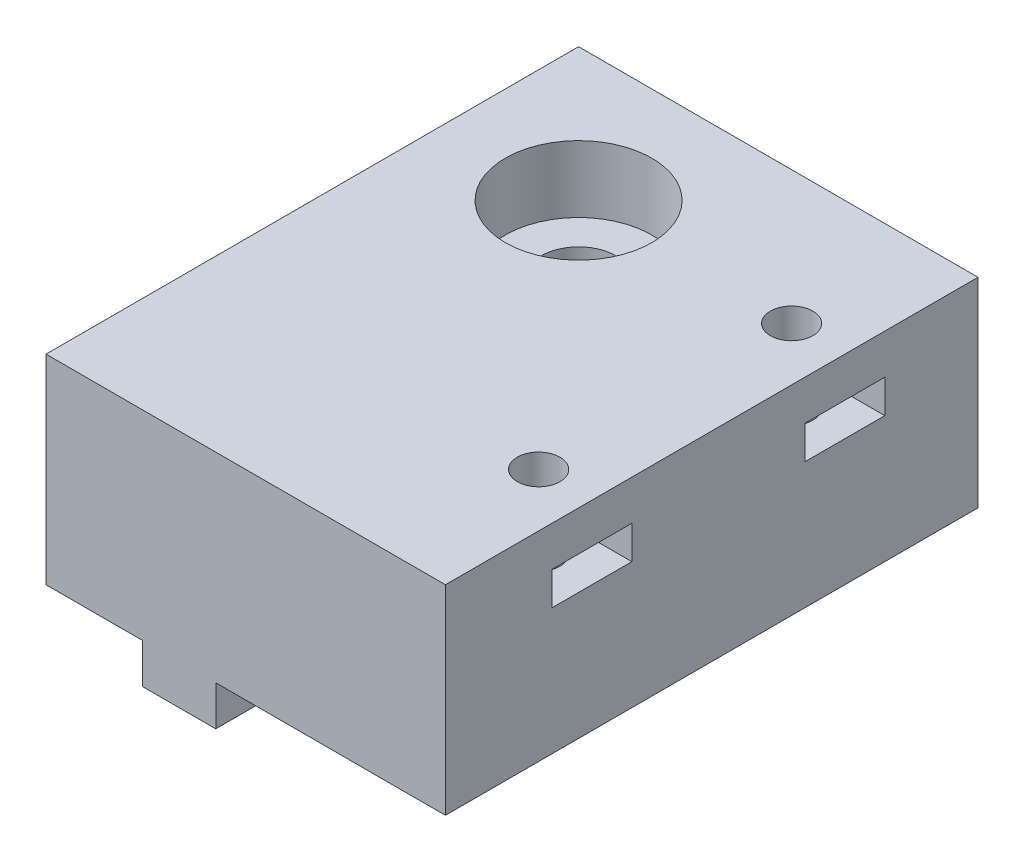
ISO-10303-21;
HEADER;
FILE_DESCRIPTION(('STEP AP214'),'2;1');
FILE_NAME('part.step','',(''),(''),'','','');
FILE_SCHEMA(('AUTOMOTIVE_DESIGN { 1 0 10303 214 1 1 1 1 }'));
ENDSEC;
DATA;
#1=APPLICATION_CONTEXT('core data for automotive mechanical design processes');
#2=APPLICATION_PROTOCOL_DEFINITION('international standard','automotive_design',2000,#1);
#3=PRODUCT_CONTEXT('',#1,'mechanical');
#4=PRODUCT('Part','Part','',(#3));
#5=PRODUCT_RELATED_PRODUCT_CATEGORY('part','',(#4));
#6=PRODUCT_DEFINITION_FORMATION('','',#4);
#7=PRODUCT_DEFINITION_CONTEXT('part definition',#1,'design');
#8=PRODUCT_DEFINITION('design','',#6,#7);
#9=PRODUCT_DEFINITION_SHAPE('','',#8);
#10=(LENGTH_UNIT() NAMED_UNIT(*) SI_UNIT(.MILLI.,.METRE.));
#11=(NAMED_UNIT(*) PLANE_ANGLE_UNIT() SI_UNIT($,.RADIAN.));
#12=(NAMED_UNIT(*) SI_UNIT($,.STERADIAN.) SOLID_ANGLE_UNIT());
#13=UNCERTAINTY_MEASURE_WITH_UNIT(LENGTH_MEASURE(1.E-05),#10,'distance_accuracy_value','');
#14=(GEOMETRIC_REPRESENTATION_CONTEXT(3) GLOBAL_UNCERTAINTY_ASSIGNED_CONTEXT((#13)) GLOBAL_UNIT_ASSIGNED_CONTEXT((#10,
#11,#12)) REPRESENTATION_CONTEXT('',''));
#15=CARTESIAN_POINT('',(0.,0.,0.));
#16=DIRECTION('',(0.,0.,1.));
#17=DIRECTION('',(1.,0.,0.));
#18=AXIS2_PLACEMENT_3D('',#15,#16,#17);
#19=CARTESIAN_POINT('',(0.,0.,0.));
#20=DIRECTION('',(0.,-1.,0.));
#21=DIRECTION('',(0.,0.,-1.));
#22=AXIS2_PLACEMENT_3D('',#19,#20,#21);
#23=PLANE('',#22);
#24=CARTESIAN_POINT('',(9.30324177956045,0.,-30.));
#25=DIRECTION('',(0.,1.,0.));
#26=DIRECTION('',(0.,0.,1.));
#27=AXIS2_PLACEMENT_3D('',#24,#25,#26);
#28=CIRCLE('',#27,2.8);
#29=CARTESIAN_POINT('',(9.30324177956045,0.,-27.2));
#30=VERTEX_POINT('',#29);
#31=EDGE_CURVE('E235',#30,#30,#28,.T.);
#32=ORIENTED_EDGE('',*,*,#31,.T.);
#33=EDGE_LOOP('',(#32));
#34=FACE_BOUND('',#33,.T.);
#35=CARTESIAN_POINT('',(25.3032417795605,0.,-30.));
#36=DIRECTION('',(0.,1.,0.));
#37=DIRECTION('',(0.,0.,1.));
#38=AXIS2_PLACEMENT_3D('',#35,#36,#37);
#39=CIRCLE('',#38,1.60000000000001);
#40=CARTESIAN_POINT('',(25.3032417795605,0.,-28.4));
#41=VERTEX_POINT('',#40);
#42=EDGE_CURVE('E305',#41,#41,#39,.T.);
#43=ORIENTED_EDGE('',*,*,#42,.T.);
#44=EDGE_LOOP('',(#43));
#45=FACE_BOUND('',#44,.T.);
#46=CARTESIAN_POINT('',(25.3032417795605,0.,-11.));
#47=DIRECTION('',(0.,1.,0.));
#48=DIRECTION('',(0.,0.,1.));
#49=AXIS2_PLACEMENT_3D('',#46,#47,#48);
#50=CIRCLE('',#49,1.6);
#51=CARTESIAN_POINT('',(25.3032417795605,0.,-9.4));
#52=VERTEX_POINT('',#51);
#53=EDGE_CURVE('E313',#52,#52,#50,.T.);
#54=ORIENTED_EDGE('',*,*,#53,.T.);
#55=EDGE_LOOP('',(#54));
#56=FACE_BOUND('',#55,.T.);
#57=DIRECTION('',(-1.,0.,0.));
#58=VECTOR('',#57,1.);
#59=CARTESIAN_POINT('',(6.55324177956045,0.,-37.5));
#60=LINE('',#59,#58);
#61=CARTESIAN_POINT('',(12.0532417795605,0.,-37.5));
#62=VERTEX_POINT('',#61);
#63=CARTESIAN_POINT('',(6.55324177956045,0.,-37.5));
#64=VERTEX_POINT('',#63);
#65=EDGE_CURVE('E470',#62,#64,#60,.T.);
#66=ORIENTED_EDGE('',*,*,#65,.F.);
#67=DIRECTION('',(0.,0.,1.));
#68=VECTOR('',#67,1.);
#69=CARTESIAN_POINT('',(12.0532417795605,0.,-37.5));
#70=LINE('',#69,#68);
#71=CARTESIAN_POINT('',(12.0532417795605,0.,-40.));
#72=VERTEX_POINT('',#71);
#73=EDGE_CURVE('E196',#72,#62,#70,.T.);
#74=ORIENTED_EDGE('',*,*,#73,.F.);
#75=DIRECTION('',(-1.,0.,0.));
#76=VECTOR('',#75,1.);
#77=CARTESIAN_POINT('',(-0.696758220439547,0.,-40.));
#78=LINE('',#77,#76);
#79=CARTESIAN_POINT('',(29.3032417795605,0.,-40.));
#80=VERTEX_POINT('',#79);
#81=EDGE_CURVE('E323',#80,#72,#78,.T.);
#82=ORIENTED_EDGE('',*,*,#81,.F.);
#83=DIRECTION('',(0.,0.,-1.));
#84=VECTOR('',#83,1.);
#85=CARTESIAN_POINT('',(29.3032417795605,0.,0.));
#86=LINE('',#85,#84);
#87=CARTESIAN_POINT('',(29.3032417795605,0.,0.));
#88=VERTEX_POINT('',#87);
#89=EDGE_CURVE('E336',#88,#80,#86,.T.);
#90=ORIENTED_EDGE('',*,*,#89,.F.);
#91=DIRECTION('',(1.,0.,0.));
#92=VECTOR('',#91,1.);
#93=CARTESIAN_POINT('',(-0.696758220439547,0.,0.));
#94=LINE('',#93,#92);
#95=CARTESIAN_POINT('',(12.0532417795604,0.,0.));
#96=VERTEX_POINT('',#95);
#97=EDGE_CURVE('E332',#96,#88,#94,.T.);
#98=ORIENTED_EDGE('',*,*,#97,.F.);
#99=DIRECTION('',(0.,0.,1.));
#100=VECTOR('',#99,1.);
#101=CARTESIAN_POINT('',(12.0532417795604,0.,0.));
#102=LINE('',#101,#100);
#103=CARTESIAN_POINT('',(12.0532417795605,0.,-22.5));
#104=VERTEX_POINT('',#103);
#105=EDGE_CURVE('E209',#104,#96,#102,.T.);
#106=ORIENTED_EDGE('',*,*,#105,.F.);
#107=DIRECTION('',(1.,0.,0.));
#108=VECTOR('',#107,1.);
#109=CARTESIAN_POINT('',(6.55324177956045,0.,-22.5));
#110=LINE('',#109,#108);
#111=CARTESIAN_POINT('',(6.55324177956045,0.,-22.5));
#112=VERTEX_POINT('',#111);
#113=EDGE_CURVE('E60',#112,#104,#110,.T.);
#114=ORIENTED_EDGE('',*,*,#113,.F.);
#115=DIRECTION('',(0.,0.,-1.));
#116=VECTOR('',#115,1.);
#117=CARTESIAN_POINT('',(6.55324177956045,0.,0.));
#118=LINE('',#117,#116);
#119=CARTESIAN_POINT('',(6.55324177956045,0.,0.));
#120=VERTEX_POINT('',#119);
#121=EDGE_CURVE('E198',#120,#112,#118,.T.);
#122=ORIENTED_EDGE('',*,*,#121,.F.);
#123=CARTESIAN_POINT('',(-0.696758220439547,0.,0.));
#124=VERTEX_POINT('',#123);
#125=EDGE_CURVE('E333',#124,#120,#94,.T.);
#126=ORIENTED_EDGE('',*,*,#125,.F.);
#127=DIRECTION('',(0.,0.,1.));
#128=VECTOR('',#127,1.);
#129=CARTESIAN_POINT('',(-0.696758220439547,0.,0.));
#130=LINE('',#129,#128);
#131=CARTESIAN_POINT('',(-0.696758220439547,0.,-40.));
#132=VERTEX_POINT('',#131);
#133=EDGE_CURVE('E316',#132,#124,#130,.T.);
#134=ORIENTED_EDGE('',*,*,#133,.F.);
#135=CARTESIAN_POINT('',(6.55324177956046,0.,-40.));
#136=VERTEX_POINT('',#135);
#137=EDGE_CURVE('E338',#136,#132,#78,.T.);
#138=ORIENTED_EDGE('',*,*,#137,.F.);
#139=DIRECTION('',(0.,0.,-1.));
#140=VECTOR('',#139,1.);
#141=CARTESIAN_POINT('',(6.55324177956045,0.,-37.5));
#142=LINE('',#141,#140);
#143=EDGE_CURVE('E192',#64,#136,#142,.T.);
#144=ORIENTED_EDGE('',*,*,#143,.F.);
#145=EDGE_LOOP('',(#66,#74,#82,#90,#98,#106,#114,#122,#126,#134,#138,#144));
#146=FACE_BOUND('',#145,.T.);
#147=ADVANCED_FACE('F35',(#34,#45,#56,#146),#23,.T.);
#148=CARTESIAN_POINT('',(9.30324177956045,0.,-30.));
#149=DIRECTION('',(0.,1.,0.));
#150=DIRECTION('',(0.,0.,1.));
#151=AXIS2_PLACEMENT_3D('',#148,#149,#150);
#152=CYLINDRICAL_SURFACE('',#151,2.8);
#153=ORIENTED_EDGE('',*,*,#31,.F.);
#154=EDGE_LOOP('',(#153));
#155=FACE_BOUND('',#154,.T.);
#156=CARTESIAN_POINT('',(9.30324177956045,10.,-30.));
#157=DIRECTION('',(0.,1.,0.));
#158=DIRECTION('',(0.,0.,1.));
#159=AXIS2_PLACEMENT_3D('',#156,#157,#158);
#160=CIRCLE('',#159,2.8);
#161=CARTESIAN_POINT('',(9.30324177956045,10.,-27.2));
#162=VERTEX_POINT('',#161);
#163=EDGE_CURVE('E39',#162,#162,#160,.F.);
#164=ORIENTED_EDGE('',*,*,#163,.F.);
#165=EDGE_LOOP('',(#164));
#166=FACE_BOUND('',#165,.T.);
#167=ADVANCED_FACE('F378',(#155,#166),#152,.F.);
#168=CARTESIAN_POINT('',(25.3032417795605,0.,-30.));
#169=DIRECTION('',(0.,1.,0.));
#170=DIRECTION('',(0.,0.,1.));
#171=AXIS2_PLACEMENT_3D('',#168,#169,#170);
#172=CYLINDRICAL_SURFACE('',#171,1.60000000000001);
#173=CARTESIAN_POINT('',(25.3032417795605,12.,-30.));
#174=DIRECTION('',(0.,1.,0.));
#175=DIRECTION('',(0.,0.,1.));
#176=AXIS2_PLACEMENT_3D('',#173,#174,#175);
#177=CIRCLE('',#176,1.60000000000001);
#178=CARTESIAN_POINT('',(25.3032417795605,12.,-28.4));
#179=VERTEX_POINT('',#178);
#180=EDGE_CURVE('E288',#179,#179,#177,.F.);
#181=ORIENTED_EDGE('',*,*,#180,.T.);
#182=EDGE_LOOP('',(#181));
#183=FACE_BOUND('',#182,.T.);
#184=CARTESIAN_POINT('',(25.3032417795605,15.,-30.));
#185=DIRECTION('',(0.,1.,0.));
#186=DIRECTION('',(0.,0.,1.));
#187=AXIS2_PLACEMENT_3D('',#184,#185,#186);
#188=CIRCLE('',#187,1.60000000000001);
#189=CARTESIAN_POINT('',(25.3032417795605,15.,-28.4));
#190=VERTEX_POINT('',#189);
#191=EDGE_CURVE('E309',#190,#190,#188,.T.);
#192=ORIENTED_EDGE('',*,*,#191,.T.);
#193=EDGE_LOOP('',(#192));
#194=FACE_BOUND('',#193,.T.);
#195=ADVANCED_FACE('F356',(#183,#194),#172,.F.);
#196=CARTESIAN_POINT('',(25.3032417795605,0.,-11.));
#197=DIRECTION('',(0.,1.,0.));
#198=DIRECTION('',(0.,0.,1.));
#199=AXIS2_PLACEMENT_3D('',#196,#197,#198);
#200=CYLINDRICAL_SURFACE('',#199,1.6);
#201=CARTESIAN_POINT('',(25.3032417795605,12.,-11.));
#202=DIRECTION('',(0.,1.,0.));
#203=DIRECTION('',(0.,0.,1.));
#204=AXIS2_PLACEMENT_3D('',#201,#202,#203);
#205=CIRCLE('',#204,1.6);
#206=CARTESIAN_POINT('',(25.3032417795605,12.,-9.4));
#207=VERTEX_POINT('',#206);
#208=EDGE_CURVE('E312',#207,#207,#205,.F.);
#209=ORIENTED_EDGE('',*,*,#208,.T.);
#210=EDGE_LOOP('',(#209));
#211=FACE_BOUND('',#210,.T.);
#212=CARTESIAN_POINT('',(25.3032417795605,15.,-11.));
#213=DIRECTION('',(0.,1.,0.));
#214=DIRECTION('',(0.,0.,1.));
#215=AXIS2_PLACEMENT_3D('',#212,#213,#214);
#216=CIRCLE('',#215,1.6);
#217=CARTESIAN_POINT('',(25.3032417795605,15.,-9.4));
#218=VERTEX_POINT('',#217);
#219=EDGE_CURVE('E308',#218,#218,#216,.T.);
#220=ORIENTED_EDGE('',*,*,#219,.T.);
#221=EDGE_LOOP('',(#220));
#222=FACE_BOUND('',#221,.T.);
#223=ADVANCED_FACE('F403',(#211,#222),#200,.F.);
#224=CARTESIAN_POINT('',(-0.696758220439547,15.,0.));
#225=DIRECTION('',(1.,0.,0.));
#226=DIRECTION('',(0.,0.,-1.));
#227=AXIS2_PLACEMENT_3D('',#224,#225,#226);
#228=PLANE('',#227);
#229=ORIENTED_EDGE('',*,*,#133,.T.);
#230=DIRECTION('',(0.,-1.,0.));
#231=VECTOR('',#230,1.);
#232=CARTESIAN_POINT('',(-0.696758220439547,15.,0.));
#233=LINE('',#232,#231);
#234=CARTESIAN_POINT('',(-0.696758220439547,15.,0.));
#235=VERTEX_POINT('',#234);
#236=EDGE_CURVE('E11',#235,#124,#233,.T.);
#237=ORIENTED_EDGE('',*,*,#236,.F.);
#238=DIRECTION('',(0.,0.,1.));
#239=VECTOR('',#238,1.);
#240=CARTESIAN_POINT('',(-0.696758220439547,15.,0.));
#241=LINE('',#240,#239);
#242=CARTESIAN_POINT('',(-0.696758220439547,15.,-40.));
#243=VERTEX_POINT('',#242);
#244=EDGE_CURVE('E319',#243,#235,#241,.T.);
#245=ORIENTED_EDGE('',*,*,#244,.F.);
#246=DIRECTION('',(0.,-1.,0.));
#247=VECTOR('',#246,1.);
#248=CARTESIAN_POINT('',(-0.696758220439547,15.,-40.));
#249=LINE('',#248,#247);
#250=EDGE_CURVE('E329',#243,#132,#249,.T.);
#251=ORIENTED_EDGE('',*,*,#250,.T.);
#252=EDGE_LOOP('',(#229,#237,#245,#251));
#253=FACE_BOUND('',#252,.T.);
#254=ADVANCED_FACE('F37',(#253),#228,.F.);
#255=CARTESIAN_POINT('',(-0.696758220439547,15.,0.));
#256=DIRECTION('',(0.,0.,-1.));
#257=DIRECTION('',(-1.,0.,0.));
#258=AXIS2_PLACEMENT_3D('',#255,#256,#257);
#259=PLANE('',#258);
#260=ORIENTED_EDGE('',*,*,#125,.T.);
#261=DIRECTION('',(0.,1.,0.));
#262=VECTOR('',#261,1.);
#263=CARTESIAN_POINT('',(6.55324177956045,-3.,0.));
#264=LINE('',#263,#262);
#265=CARTESIAN_POINT('',(6.55324177956045,-3.,0.));
#266=VERTEX_POINT('',#265);
#267=EDGE_CURVE('E214',#266,#120,#264,.T.);
#268=ORIENTED_EDGE('',*,*,#267,.F.);
#269=DIRECTION('',(-1.,0.,0.));
#270=VECTOR('',#269,1.);
#271=CARTESIAN_POINT('',(6.55324177956045,-3.,0.));
#272=LINE('',#271,#270);
#273=CARTESIAN_POINT('',(12.0532417795604,-3.,0.));
#274=VERTEX_POINT('',#273);
#275=EDGE_CURVE('E213',#274,#266,#272,.T.);
#276=ORIENTED_EDGE('',*,*,#275,.F.);
#277=DIRECTION('',(0.,1.,0.));
#278=VECTOR('',#277,1.);
#279=CARTESIAN_POINT('',(12.0532417795604,-3.,0.));
#280=LINE('',#279,#278);
#281=EDGE_CURVE('E221',#274,#96,#280,.T.);
#282=ORIENTED_EDGE('',*,*,#281,.T.);
#283=ORIENTED_EDGE('',*,*,#97,.T.);
#284=DIRECTION('',(0.,-1.,0.));
#285=VECTOR('',#284,1.);
#286=CARTESIAN_POINT('',(29.3032417795605,15.,0.));
#287=LINE('',#286,#285);
#288=CARTESIAN_POINT('',(29.3032417795605,15.,0.));
#289=VERTEX_POINT('',#288);
#290=EDGE_CURVE('E44',#289,#88,#287,.T.);
#291=ORIENTED_EDGE('',*,*,#290,.F.);
#292=DIRECTION('',(1.,0.,0.));
#293=VECTOR('',#292,1.);
#294=CARTESIAN_POINT('',(-0.696758220439547,15.,0.));
#295=LINE('',#294,#293);
#296=EDGE_CURVE('E322',#235,#289,#295,.T.);
#297=ORIENTED_EDGE('',*,*,#296,.F.);
#298=ORIENTED_EDGE('',*,*,#236,.T.);
#299=EDGE_LOOP('',(#260,#268,#276,#282,#283,#291,#297,#298));
#300=FACE_BOUND('',#299,.T.);
#301=ADVANCED_FACE('F396',(#300),#259,.F.);
#302=CARTESIAN_POINT('',(29.3032417795605,15.,0.));
#303=DIRECTION('',(-1.,0.,0.));
#304=DIRECTION('',(0.,0.,1.));
#305=AXIS2_PLACEMENT_3D('',#302,#303,#304);
#306=PLANE('',#305);
#307=DIRECTION('',(0.,0.,-1.));
#308=VECTOR('',#307,1.);
#309=CARTESIAN_POINT('',(29.3032417795605,9.5,-27.));
#310=LINE('',#309,#308);
#311=CARTESIAN_POINT('',(29.3032417795605,9.5,-27.));
#312=VERTEX_POINT('',#311);
#313=CARTESIAN_POINT('',(29.3032417795605,9.5,-33.));
#314=VERTEX_POINT('',#313);
#315=EDGE_CURVE('E254',#312,#314,#310,.T.);
#316=ORIENTED_EDGE('',*,*,#315,.F.);
#317=DIRECTION('',(0.,-1.,0.));
#318=VECTOR('',#317,1.);
#319=CARTESIAN_POINT('',(29.3032417795605,12.,-27.));
#320=LINE('',#319,#318);
#321=CARTESIAN_POINT('',(29.3032417795605,12.,-27.));
#322=VERTEX_POINT('',#321);
#323=EDGE_CURVE('E238',#322,#312,#320,.T.);
#324=ORIENTED_EDGE('',*,*,#323,.F.);
#325=DIRECTION('',(0.,0.,1.));
#326=VECTOR('',#325,1.);
#327=CARTESIAN_POINT('',(29.3032417795605,12.,-27.));
#328=LINE('',#327,#326);
#329=CARTESIAN_POINT('',(29.3032417795605,12.,-33.));
#330=VERTEX_POINT('',#329);
#331=EDGE_CURVE('E243',#330,#322,#328,.T.);
#332=ORIENTED_EDGE('',*,*,#331,.F.);
#333=DIRECTION('',(0.,1.,0.));
#334=VECTOR('',#333,1.);
#335=CARTESIAN_POINT('',(29.3032417795605,12.,-33.));
#336=LINE('',#335,#334);
#337=EDGE_CURVE('E257',#314,#330,#336,.T.);
#338=ORIENTED_EDGE('',*,*,#337,.F.);
#339=EDGE_LOOP('',(#316,#324,#332,#338));
#340=FACE_BOUND('',#339,.T.);
#341=DIRECTION('',(0.,0.,-1.));
#342=VECTOR('',#341,1.);
#343=CARTESIAN_POINT('',(29.3032417795605,9.5,-8.));
#344=LINE('',#343,#342);
#345=CARTESIAN_POINT('',(29.3032417795605,9.5,-8.));
#346=VERTEX_POINT('',#345);
#347=CARTESIAN_POINT('',(29.3032417795605,9.5,-14.));
#348=VERTEX_POINT('',#347);
#349=EDGE_CURVE('E287',#346,#348,#344,.T.);
#350=ORIENTED_EDGE('',*,*,#349,.F.);
#351=DIRECTION('',(0.,-1.,0.));
#352=VECTOR('',#351,1.);
#353=CARTESIAN_POINT('',(29.3032417795605,12.,-8.));
#354=LINE('',#353,#352);
#355=CARTESIAN_POINT('',(29.3032417795605,12.,-8.));
#356=VERTEX_POINT('',#355);
#357=EDGE_CURVE('E285',#356,#346,#354,.T.);
#358=ORIENTED_EDGE('',*,*,#357,.F.);
#359=DIRECTION('',(0.,0.,1.));
#360=VECTOR('',#359,1.);
#361=CARTESIAN_POINT('',(29.3032417795605,12.,-8.));
#362=LINE('',#361,#360);
#363=CARTESIAN_POINT('',(29.3032417795605,12.,-14.));
#364=VERTEX_POINT('',#363);
#365=EDGE_CURVE('E275',#364,#356,#362,.T.);
#366=ORIENTED_EDGE('',*,*,#365,.F.);
#367=DIRECTION('',(0.,1.,0.));
#368=VECTOR('',#367,1.);
#369=CARTESIAN_POINT('',(29.3032417795605,12.,-14.));
#370=LINE('',#369,#368);
#371=EDGE_CURVE('E291',#348,#364,#370,.T.);
#372=ORIENTED_EDGE('',*,*,#371,.F.);
#373=EDGE_LOOP('',(#350,#358,#366,#372));
#374=FACE_BOUND('',#373,.T.);
#375=ORIENTED_EDGE('',*,*,#89,.T.);
#376=DIRECTION('',(0.,-1.,0.));
#377=VECTOR('',#376,1.);
#378=CARTESIAN_POINT('',(29.3032417795605,15.,-40.));
#379=LINE('',#378,#377);
#380=CARTESIAN_POINT('',(29.3032417795605,15.,-40.));
#381=VERTEX_POINT('',#380);
#382=EDGE_CURVE('E343',#381,#80,#379,.T.);
#383=ORIENTED_EDGE('',*,*,#382,.F.);
#384=DIRECTION('',(0.,0.,-1.));
#385=VECTOR('',#384,1.);
#386=CARTESIAN_POINT('',(29.3032417795605,15.,0.));
#387=LINE('',#386,#385);
#388=EDGE_CURVE('E325',#289,#381,#387,.T.);
#389=ORIENTED_EDGE('',*,*,#388,.F.);
#390=ORIENTED_EDGE('',*,*,#290,.T.);
#391=EDGE_LOOP('',(#375,#383,#389,#390));
#392=FACE_BOUND('',#391,.T.);
#393=ADVANCED_FACE('F394',(#340,#374,#392),#306,.F.);
#394=CARTESIAN_POINT('',(-0.696758220439547,15.,-40.));
#395=DIRECTION('',(0.,0.,1.));
#396=DIRECTION('',(1.,0.,0.));
#397=AXIS2_PLACEMENT_3D('',#394,#395,#396);
#398=PLANE('',#397);
#399=ORIENTED_EDGE('',*,*,#81,.T.);
#400=DIRECTION('',(0.,1.,0.));
#401=VECTOR('',#400,1.);
#402=CARTESIAN_POINT('',(12.0532417795605,-3.,-40.));
#403=LINE('',#402,#401);
#404=CARTESIAN_POINT('',(12.0532417795605,-3.,-40.));
#405=VERTEX_POINT('',#404);
#406=EDGE_CURVE('E477',#405,#72,#403,.T.);
#407=ORIENTED_EDGE('',*,*,#406,.F.);
#408=DIRECTION('',(1.,0.,0.));
#409=VECTOR('',#408,1.);
#410=CARTESIAN_POINT('',(6.55324177956046,-3.,-40.));
#411=LINE('',#410,#409);
#412=CARTESIAN_POINT('',(6.55324177956046,-3.,-40.));
#413=VERTEX_POINT('',#412);
#414=EDGE_CURVE('E189',#413,#405,#411,.T.);
#415=ORIENTED_EDGE('',*,*,#414,.F.);
#416=DIRECTION('',(0.,1.,0.));
#417=VECTOR('',#416,1.);
#418=CARTESIAN_POINT('',(6.55324177956046,-3.,-40.));
#419=LINE('',#418,#417);
#420=EDGE_CURVE('E52',#413,#136,#419,.T.);
#421=ORIENTED_EDGE('',*,*,#420,.T.);
#422=ORIENTED_EDGE('',*,*,#137,.T.);
#423=ORIENTED_EDGE('',*,*,#250,.F.);
#424=DIRECTION('',(-1.,0.,0.));
#425=VECTOR('',#424,1.);
#426=CARTESIAN_POINT('',(-0.696758220439547,15.,-40.));
#427=LINE('',#426,#425);
#428=EDGE_CURVE('E327',#381,#243,#427,.T.);
#429=ORIENTED_EDGE('',*,*,#428,.F.);
#430=ORIENTED_EDGE('',*,*,#382,.T.);
#431=EDGE_LOOP('',(#399,#407,#415,#421,#422,#423,#429,#430));
#432=FACE_BOUND('',#431,.T.);
#433=ADVANCED_FACE('F391',(#432),#398,.F.);
#434=CARTESIAN_POINT('',(0.,15.,0.));
#435=DIRECTION('',(0.,-1.,0.));
#436=DIRECTION('',(0.,0.,-1.));
#437=AXIS2_PLACEMENT_3D('',#434,#435,#436);
#438=PLANE('',#437);
#439=CARTESIAN_POINT('',(9.30324177956045,15.,-30.));
#440=DIRECTION('',(0.,1.,0.));
#441=DIRECTION('',(0.,0.,1.));
#442=AXIS2_PLACEMENT_3D('',#439,#440,#441);
#443=CIRCLE('',#442,5.5);
#444=CARTESIAN_POINT('',(9.30324177956045,15.,-24.5));
#445=VERTEX_POINT('',#444);
#446=EDGE_CURVE('E229',#445,#445,#443,.T.);
#447=ORIENTED_EDGE('',*,*,#446,.F.);
#448=EDGE_LOOP('',(#447));
#449=FACE_BOUND('',#448,.T.);
#450=ORIENTED_EDGE('',*,*,#191,.F.);
#451=EDGE_LOOP('',(#450));
#452=FACE_BOUND('',#451,.T.);
#453=ORIENTED_EDGE('',*,*,#219,.F.);
#454=EDGE_LOOP('',(#453));
#455=FACE_BOUND('',#454,.T.);
#456=ORIENTED_EDGE('',*,*,#244,.T.);
#457=ORIENTED_EDGE('',*,*,#296,.T.);
#458=ORIENTED_EDGE('',*,*,#388,.T.);
#459=ORIENTED_EDGE('',*,*,#428,.T.);
#460=EDGE_LOOP('',(#456,#457,#458,#459));
#461=FACE_BOUND('',#460,.T.);
#462=ADVANCED_FACE('F389',(#449,#452,#455,#461),#438,.F.);
#463=CARTESIAN_POINT('',(25.3032417795605,9.5,-11.));
#464=DIRECTION('',(0.,-1.,0.));
#465=DIRECTION('',(0.,0.,-1.));
#466=AXIS2_PLACEMENT_3D('',#463,#464,#465);
#467=CIRCLE('',#466,1.6);
#468=CARTESIAN_POINT('',(25.3032417795605,9.5,-12.6));
#469=VERTEX_POINT('',#468);
#470=EDGE_CURVE('E298',#469,#469,#467,.F.);
#471=ORIENTED_EDGE('',*,*,#470,.T.);
#472=EDGE_LOOP('',(#471));
#473=FACE_BOUND('',#472,.T.);
#474=ORIENTED_EDGE('',*,*,#53,.F.);
#475=EDGE_LOOP('',(#474));
#476=FACE_BOUND('',#475,.T.);
#477=ADVANCED_FACE('F484',(#473,#476),#200,.F.);
#478=CARTESIAN_POINT('',(25.3032417795605,9.5,-30.));
#479=DIRECTION('',(0.,-1.,0.));
#480=DIRECTION('',(0.,0.,-1.));
#481=AXIS2_PLACEMENT_3D('',#478,#479,#480);
#482=CIRCLE('',#481,1.60000000000001);
#483=CARTESIAN_POINT('',(25.3032417795605,9.5,-31.6));
#484=VERTEX_POINT('',#483);
#485=EDGE_CURVE('E264',#484,#484,#482,.F.);
#486=ORIENTED_EDGE('',*,*,#485,.T.);
#487=EDGE_LOOP('',(#486));
#488=FACE_BOUND('',#487,.T.);
#489=ORIENTED_EDGE('',*,*,#42,.F.);
#490=EDGE_LOOP('',(#489));
#491=FACE_BOUND('',#490,.T.);
#492=ADVANCED_FACE('F489',(#488,#491),#172,.F.);
#493=CARTESIAN_POINT('',(21.3032417795605,12.,-8.));
#494=DIRECTION('',(0.,1.,0.));
#495=DIRECTION('',(0.,0.,1.));
#496=AXIS2_PLACEMENT_3D('',#493,#494,#495);
#497=PLANE('',#496);
#498=ORIENTED_EDGE('',*,*,#365,.T.);
#499=DIRECTION('',(1.,0.,0.));
#500=VECTOR('',#499,1.);
#501=CARTESIAN_POINT('',(21.3032417795605,12.,-8.));
#502=LINE('',#501,#500);
#503=CARTESIAN_POINT('',(21.3032417795605,12.,-8.));
#504=VERTEX_POINT('',#503);
#505=EDGE_CURVE('E296',#504,#356,#502,.T.);
#506=ORIENTED_EDGE('',*,*,#505,.F.);
#507=DIRECTION('',(0.,0.,1.));
#508=VECTOR('',#507,1.);
#509=CARTESIAN_POINT('',(21.3032417795605,12.,-8.));
#510=LINE('',#509,#508);
#511=CARTESIAN_POINT('',(21.3032417795605,12.,-14.));
#512=VERTEX_POINT('',#511);
#513=EDGE_CURVE('E281',#512,#504,#510,.T.);
#514=ORIENTED_EDGE('',*,*,#513,.F.);
#515=DIRECTION('',(1.,0.,0.));
#516=VECTOR('',#515,1.);
#517=CARTESIAN_POINT('',(21.3032417795605,12.,-14.));
#518=LINE('',#517,#516);
#519=EDGE_CURVE('E299',#512,#364,#518,.T.);
#520=ORIENTED_EDGE('',*,*,#519,.T.);
#521=EDGE_LOOP('',(#498,#506,#514,#520));
#522=FACE_BOUND('',#521,.T.);
#523=ORIENTED_EDGE('',*,*,#208,.F.);
#524=EDGE_LOOP('',(#523));
#525=FACE_BOUND('',#524,.T.);
#526=ADVANCED_FACE('F505',(#522,#525),#497,.F.);
#527=CARTESIAN_POINT('',(21.3032417795605,9.5,-8.));
#528=DIRECTION('',(0.,-1.,0.));
#529=DIRECTION('',(0.,0.,-1.));
#530=AXIS2_PLACEMENT_3D('',#527,#528,#529);
#531=PLANE('',#530);
#532=ORIENTED_EDGE('',*,*,#349,.T.);
#533=DIRECTION('',(1.,0.,0.));
#534=VECTOR('',#533,1.);
#535=CARTESIAN_POINT('',(21.3032417795605,9.5,-14.));
#536=LINE('',#535,#534);
#537=CARTESIAN_POINT('',(21.3032417795605,9.5,-14.));
#538=VERTEX_POINT('',#537);
#539=EDGE_CURVE('E301',#538,#348,#536,.T.);
#540=ORIENTED_EDGE('',*,*,#539,.F.);
#541=DIRECTION('',(0.,0.,-1.));
#542=VECTOR('',#541,1.);
#543=CARTESIAN_POINT('',(21.3032417795605,9.5,-8.));
#544=LINE('',#543,#542);
#545=CARTESIAN_POINT('',(21.3032417795605,9.5,-8.));
#546=VERTEX_POINT('',#545);
#547=EDGE_CURVE('E274',#546,#538,#544,.T.);
#548=ORIENTED_EDGE('',*,*,#547,.F.);
#549=DIRECTION('',(1.,0.,0.));
#550=VECTOR('',#549,1.);
#551=CARTESIAN_POINT('',(21.3032417795605,9.5,-8.));
#552=LINE('',#551,#550);
#553=EDGE_CURVE('E284',#546,#346,#552,.T.);
#554=ORIENTED_EDGE('',*,*,#553,.T.);
#555=EDGE_LOOP('',(#532,#540,#548,#554));
#556=FACE_BOUND('',#555,.T.);
#557=ORIENTED_EDGE('',*,*,#470,.F.);
#558=EDGE_LOOP('',(#557));
#559=FACE_BOUND('',#558,.T.);
#560=ADVANCED_FACE('F510',(#556,#559),#531,.F.);
#561=CARTESIAN_POINT('',(21.3032417795605,12.,-8.));
#562=DIRECTION('',(0.,0.,1.));
#563=DIRECTION('',(1.,0.,0.));
#564=AXIS2_PLACEMENT_3D('',#561,#562,#563);
#565=PLANE('',#564);
#566=ORIENTED_EDGE('',*,*,#357,.T.);
#567=ORIENTED_EDGE('',*,*,#553,.F.);
#568=DIRECTION('',(0.,-1.,0.));
#569=VECTOR('',#568,1.);
#570=CARTESIAN_POINT('',(21.3032417795605,12.,-8.));
#571=LINE('',#570,#569);
#572=EDGE_CURVE('E271',#504,#546,#571,.T.);
#573=ORIENTED_EDGE('',*,*,#572,.F.);
#574=ORIENTED_EDGE('',*,*,#505,.T.);
#575=EDGE_LOOP('',(#566,#567,#573,#574));
#576=FACE_BOUND('',#575,.T.);
#577=ADVANCED_FACE('F507',(#576),#565,.F.);
#578=CARTESIAN_POINT('',(21.3032417795605,12.,-14.));
#579=DIRECTION('',(0.,0.,-1.));
#580=DIRECTION('',(-1.,0.,0.));
#581=AXIS2_PLACEMENT_3D('',#578,#579,#580);
#582=PLANE('',#581);
#583=ORIENTED_EDGE('',*,*,#371,.T.);
#584=ORIENTED_EDGE('',*,*,#519,.F.);
#585=DIRECTION('',(0.,1.,0.));
#586=VECTOR('',#585,1.);
#587=CARTESIAN_POINT('',(21.3032417795605,12.,-14.));
#588=LINE('',#587,#586);
#589=EDGE_CURVE('E278',#538,#512,#588,.T.);
#590=ORIENTED_EDGE('',*,*,#589,.F.);
#591=ORIENTED_EDGE('',*,*,#539,.T.);
#592=EDGE_LOOP('',(#583,#584,#590,#591));
#593=FACE_BOUND('',#592,.T.);
#594=ADVANCED_FACE('F372',(#593),#582,.F.);
#595=CARTESIAN_POINT('',(21.3032417795605,0.,0.));
#596=DIRECTION('',(1.,0.,0.));
#597=DIRECTION('',(0.,0.,-1.));
#598=AXIS2_PLACEMENT_3D('',#595,#596,#597);
#599=PLANE('',#598);
#600=ORIENTED_EDGE('',*,*,#572,.T.);
#601=ORIENTED_EDGE('',*,*,#547,.T.);
#602=ORIENTED_EDGE('',*,*,#589,.T.);
#603=ORIENTED_EDGE('',*,*,#513,.T.);
#604=EDGE_LOOP('',(#600,#601,#602,#603));
#605=FACE_BOUND('',#604,.T.);
#606=ADVANCED_FACE('F362',(#605),#599,.T.);
#607=CARTESIAN_POINT('',(21.3032417795605,12.,-27.));
#608=DIRECTION('',(0.,1.,0.));
#609=DIRECTION('',(0.,0.,1.));
#610=AXIS2_PLACEMENT_3D('',#607,#608,#609);
#611=PLANE('',#610);
#612=ORIENTED_EDGE('',*,*,#331,.T.);
#613=DIRECTION('',(1.,0.,0.));
#614=VECTOR('',#613,1.);
#615=CARTESIAN_POINT('',(21.3032417795605,12.,-27.));
#616=LINE('',#615,#614);
#617=CARTESIAN_POINT('',(21.3032417795605,12.,-27.));
#618=VERTEX_POINT('',#617);
#619=EDGE_CURVE('E262',#618,#322,#616,.T.);
#620=ORIENTED_EDGE('',*,*,#619,.F.);
#621=DIRECTION('',(0.,0.,1.));
#622=VECTOR('',#621,1.);
#623=CARTESIAN_POINT('',(21.3032417795605,12.,-27.));
#624=LINE('',#623,#622);
#625=CARTESIAN_POINT('',(21.3032417795605,12.,-33.));
#626=VERTEX_POINT('',#625);
#627=EDGE_CURVE('E249',#626,#618,#624,.T.);
#628=ORIENTED_EDGE('',*,*,#627,.F.);
#629=DIRECTION('',(1.,0.,0.));
#630=VECTOR('',#629,1.);
#631=CARTESIAN_POINT('',(21.3032417795605,12.,-33.));
#632=LINE('',#631,#630);
#633=EDGE_CURVE('E265',#626,#330,#632,.T.);
#634=ORIENTED_EDGE('',*,*,#633,.T.);
#635=EDGE_LOOP('',(#612,#620,#628,#634));
#636=FACE_BOUND('',#635,.T.);
#637=ORIENTED_EDGE('',*,*,#180,.F.);
#638=EDGE_LOOP('',(#637));
#639=FACE_BOUND('',#638,.T.);
#640=ADVANCED_FACE('F359',(#636,#639),#611,.F.);
#641=CARTESIAN_POINT('',(21.3032417795605,9.5,-27.));
#642=DIRECTION('',(0.,-1.,0.));
#643=DIRECTION('',(0.,0.,-1.));
#644=AXIS2_PLACEMENT_3D('',#641,#642,#643);
#645=PLANE('',#644);
#646=ORIENTED_EDGE('',*,*,#315,.T.);
#647=DIRECTION('',(1.,0.,0.));
#648=VECTOR('',#647,1.);
#649=CARTESIAN_POINT('',(21.3032417795605,9.5,-33.));
#650=LINE('',#649,#648);
#651=CARTESIAN_POINT('',(21.3032417795605,9.5,-33.));
#652=VERTEX_POINT('',#651);
#653=EDGE_CURVE('E267',#652,#314,#650,.T.);
#654=ORIENTED_EDGE('',*,*,#653,.F.);
#655=DIRECTION('',(0.,0.,-1.));
#656=VECTOR('',#655,1.);
#657=CARTESIAN_POINT('',(21.3032417795605,9.5,-27.));
#658=LINE('',#657,#656);
#659=CARTESIAN_POINT('',(21.3032417795605,9.5,-27.));
#660=VERTEX_POINT('',#659);
#661=EDGE_CURVE('E242',#660,#652,#658,.T.);
#662=ORIENTED_EDGE('',*,*,#661,.F.);
#663=DIRECTION('',(1.,0.,0.));
#664=VECTOR('',#663,1.);
#665=CARTESIAN_POINT('',(21.3032417795605,9.5,-27.));
#666=LINE('',#665,#664);
#667=EDGE_CURVE('E252',#660,#312,#666,.T.);
#668=ORIENTED_EDGE('',*,*,#667,.T.);
#669=EDGE_LOOP('',(#646,#654,#662,#668));
#670=FACE_BOUND('',#669,.T.);
#671=ORIENTED_EDGE('',*,*,#485,.F.);
#672=EDGE_LOOP('',(#671));
#673=FACE_BOUND('',#672,.T.);
#674=ADVANCED_FACE('F361',(#670,#673),#645,.F.);
#675=CARTESIAN_POINT('',(21.3032417795605,12.,-27.));
#676=DIRECTION('',(0.,0.,1.));
#677=DIRECTION('',(1.,0.,0.));
#678=AXIS2_PLACEMENT_3D('',#675,#676,#677);
#679=PLANE('',#678);
#680=ORIENTED_EDGE('',*,*,#323,.T.);
#681=ORIENTED_EDGE('',*,*,#667,.F.);
#682=DIRECTION('',(0.,-1.,0.));
#683=VECTOR('',#682,1.);
#684=CARTESIAN_POINT('',(21.3032417795605,12.,-27.));
#685=LINE('',#684,#683);
#686=EDGE_CURVE('E239',#618,#660,#685,.T.);
#687=ORIENTED_EDGE('',*,*,#686,.F.);
#688=ORIENTED_EDGE('',*,*,#619,.T.);
#689=EDGE_LOOP('',(#680,#681,#687,#688));
#690=FACE_BOUND('',#689,.T.);
#691=ADVANCED_FACE('F369',(#690),#679,.F.);
#692=CARTESIAN_POINT('',(21.3032417795605,12.,-33.));
#693=DIRECTION('',(0.,0.,-1.));
#694=DIRECTION('',(-1.,0.,0.));
#695=AXIS2_PLACEMENT_3D('',#692,#693,#694);
#696=PLANE('',#695);
#697=ORIENTED_EDGE('',*,*,#337,.T.);
#698=ORIENTED_EDGE('',*,*,#633,.F.);
#699=DIRECTION('',(0.,1.,0.));
#700=VECTOR('',#699,1.);
#701=CARTESIAN_POINT('',(21.3032417795605,12.,-33.));
#702=LINE('',#701,#700);
#703=EDGE_CURVE('E246',#652,#626,#702,.T.);
#704=ORIENTED_EDGE('',*,*,#703,.F.);
#705=ORIENTED_EDGE('',*,*,#653,.T.);
#706=EDGE_LOOP('',(#697,#698,#704,#705));
#707=FACE_BOUND('',#706,.T.);
#708=ADVANCED_FACE('F443',(#707),#696,.F.);
#709=CARTESIAN_POINT('',(21.3032417795605,0.,0.));
#710=DIRECTION('',(1.,0.,0.));
#711=DIRECTION('',(0.,0.,-1.));
#712=AXIS2_PLACEMENT_3D('',#709,#710,#711);
#713=PLANE('',#712);
#714=ORIENTED_EDGE('',*,*,#686,.T.);
#715=ORIENTED_EDGE('',*,*,#661,.T.);
#716=ORIENTED_EDGE('',*,*,#703,.T.);
#717=ORIENTED_EDGE('',*,*,#627,.T.);
#718=EDGE_LOOP('',(#714,#715,#716,#717));
#719=FACE_BOUND('',#718,.T.);
#720=ADVANCED_FACE('F438',(#719),#713,.T.);
#721=CARTESIAN_POINT('',(9.30324177956045,10.,-30.));
#722=DIRECTION('',(0.,1.,0.));
#723=DIRECTION('',(0.,0.,1.));
#724=AXIS2_PLACEMENT_3D('',#721,#722,#723);
#725=PLANE('',#724);
#726=CARTESIAN_POINT('',(9.30324177956045,10.,-30.));
#727=DIRECTION('',(0.,1.,0.));
#728=DIRECTION('',(0.,0.,1.));
#729=AXIS2_PLACEMENT_3D('',#726,#727,#728);
#730=CIRCLE('',#729,5.5);
#731=CARTESIAN_POINT('',(9.30324177956045,10.,-24.5));
#732=VERTEX_POINT('',#731);
#733=EDGE_CURVE('E230',#732,#732,#730,.T.);
#734=ORIENTED_EDGE('',*,*,#733,.T.);
#735=EDGE_LOOP('',(#734));
#736=FACE_BOUND('',#735,.T.);
#737=ORIENTED_EDGE('',*,*,#163,.T.);
#738=EDGE_LOOP('',(#737));
#739=FACE_BOUND('',#738,.T.);
#740=ADVANCED_FACE('F435',(#736,#739),#725,.T.);
#741=CARTESIAN_POINT('',(9.30324177956045,10.,-30.));
#742=DIRECTION('',(0.,1.,0.));
#743=DIRECTION('',(0.,0.,1.));
#744=AXIS2_PLACEMENT_3D('',#741,#742,#743);
#745=CYLINDRICAL_SURFACE('',#744,5.5);
#746=ORIENTED_EDGE('',*,*,#733,.F.);
#747=EDGE_LOOP('',(#746));
#748=FACE_BOUND('',#747,.T.);
#749=ORIENTED_EDGE('',*,*,#446,.T.);
#750=EDGE_LOOP('',(#749));
#751=FACE_BOUND('',#750,.T.);
#752=ADVANCED_FACE('F431',(#748,#751),#745,.F.);
#753=CARTESIAN_POINT('',(6.55324177956045,-3.,0.));
#754=DIRECTION('',(1.,0.,0.));
#755=DIRECTION('',(0.,0.,-1.));
#756=AXIS2_PLACEMENT_3D('',#753,#754,#755);
#757=PLANE('',#756);
#758=ORIENTED_EDGE('',*,*,#121,.T.);
#759=DIRECTION('',(0.,1.,0.));
#760=VECTOR('',#759,1.);
#761=CARTESIAN_POINT('',(6.55324177956045,-3.,-22.5));
#762=LINE('',#761,#760);
#763=CARTESIAN_POINT('',(6.55324177956045,-3.,-22.5));
#764=VERTEX_POINT('',#763);
#765=EDGE_CURVE('E227',#764,#112,#762,.T.);
#766=ORIENTED_EDGE('',*,*,#765,.F.);
#767=DIRECTION('',(0.,0.,-1.));
#768=VECTOR('',#767,1.);
#769=CARTESIAN_POINT('',(6.55324177956045,-3.,0.));
#770=LINE('',#769,#768);
#771=EDGE_CURVE('E205',#266,#764,#770,.T.);
#772=ORIENTED_EDGE('',*,*,#771,.F.);
#773=ORIENTED_EDGE('',*,*,#267,.T.);
#774=EDGE_LOOP('',(#758,#766,#772,#773));
#775=FACE_BOUND('',#774,.T.);
#776=ADVANCED_FACE('F411',(#775),#757,.F.);
#777=CARTESIAN_POINT('',(6.55324177956045,-3.,-22.5));
#778=DIRECTION('',(0.,0.,1.));
#779=DIRECTION('',(1.,0.,0.));
#780=AXIS2_PLACEMENT_3D('',#777,#778,#779);
#781=PLANE('',#780);
#782=ORIENTED_EDGE('',*,*,#113,.T.);
#783=DIRECTION('',(0.,1.,0.));
#784=VECTOR('',#783,1.);
#785=CARTESIAN_POINT('',(12.0532417795605,-3.,-22.5));
#786=LINE('',#785,#784);
#787=CARTESIAN_POINT('',(12.0532417795605,-3.,-22.5));
#788=VERTEX_POINT('',#787);
#789=EDGE_CURVE('E224',#788,#104,#786,.T.);
#790=ORIENTED_EDGE('',*,*,#789,.F.);
#791=DIRECTION('',(1.,0.,0.));
#792=VECTOR('',#791,1.);
#793=CARTESIAN_POINT('',(6.55324177956045,-3.,-22.5));
#794=LINE('',#793,#792);
#795=EDGE_CURVE('E208',#764,#788,#794,.T.);
#796=ORIENTED_EDGE('',*,*,#795,.F.);
#797=ORIENTED_EDGE('',*,*,#765,.T.);
#798=EDGE_LOOP('',(#782,#790,#796,#797));
#799=FACE_BOUND('',#798,.T.);
#800=ADVANCED_FACE('F423',(#799),#781,.F.);
#801=CARTESIAN_POINT('',(12.0532417795604,-3.,0.));
#802=DIRECTION('',(-1.,0.,0.));
#803=DIRECTION('',(0.,0.,1.));
#804=AXIS2_PLACEMENT_3D('',#801,#802,#803);
#805=PLANE('',#804);
#806=ORIENTED_EDGE('',*,*,#105,.T.);
#807=ORIENTED_EDGE('',*,*,#281,.F.);
#808=DIRECTION('',(0.,0.,1.));
#809=VECTOR('',#808,1.);
#810=CARTESIAN_POINT('',(12.0532417795604,-3.,0.));
#811=LINE('',#810,#809);
#812=EDGE_CURVE('E211',#788,#274,#811,.T.);
#813=ORIENTED_EDGE('',*,*,#812,.F.);
#814=ORIENTED_EDGE('',*,*,#789,.T.);
#815=EDGE_LOOP('',(#806,#807,#813,#814));
#816=FACE_BOUND('',#815,.T.);
#817=ADVANCED_FACE('F420',(#816),#805,.F.);
#818=CARTESIAN_POINT('',(0.,-3.,0.));
#819=DIRECTION('',(0.,-1.,0.));
#820=DIRECTION('',(0.,0.,-1.));
#821=AXIS2_PLACEMENT_3D('',#818,#819,#820);
#822=PLANE('',#821);
#823=ORIENTED_EDGE('',*,*,#771,.T.);
#824=ORIENTED_EDGE('',*,*,#795,.T.);
#825=ORIENTED_EDGE('',*,*,#812,.T.);
#826=ORIENTED_EDGE('',*,*,#275,.T.);
#827=EDGE_LOOP('',(#823,#824,#825,#826));
#828=FACE_BOUND('',#827,.T.);
#829=ADVANCED_FACE('F414',(#828),#822,.T.);
#830=CARTESIAN_POINT('',(12.0532417795605,-3.,-37.5));
#831=DIRECTION('',(-1.,0.,0.));
#832=DIRECTION('',(0.,0.,1.));
#833=AXIS2_PLACEMENT_3D('',#830,#831,#832);
#834=PLANE('',#833);
#835=ORIENTED_EDGE('',*,*,#73,.T.);
#836=DIRECTION('',(0.,1.,0.));
#837=VECTOR('',#836,1.);
#838=CARTESIAN_POINT('',(12.0532417795605,-3.,-37.5));
#839=LINE('',#838,#837);
#840=CARTESIAN_POINT('',(12.0532417795605,-3.,-37.5));
#841=VERTEX_POINT('',#840);
#842=EDGE_CURVE('E178',#841,#62,#839,.T.);
#843=ORIENTED_EDGE('',*,*,#842,.F.);
#844=DIRECTION('',(0.,0.,1.));
#845=VECTOR('',#844,1.);
#846=CARTESIAN_POINT('',(12.0532417795605,-3.,-37.5));
#847=LINE('',#846,#845);
#848=EDGE_CURVE('E185',#405,#841,#847,.T.);
#849=ORIENTED_EDGE('',*,*,#848,.F.);
#850=ORIENTED_EDGE('',*,*,#406,.T.);
#851=EDGE_LOOP('',(#835,#843,#849,#850));
#852=FACE_BOUND('',#851,.T.);
#853=ADVANCED_FACE('F194',(#852),#834,.F.);
#854=CARTESIAN_POINT('',(6.55324177956045,-3.,-37.5));
#855=DIRECTION('',(0.,0.,-1.));
#856=DIRECTION('',(-1.,0.,0.));
#857=AXIS2_PLACEMENT_3D('',#854,#855,#856);
#858=PLANE('',#857);
#859=ORIENTED_EDGE('',*,*,#65,.T.);
#860=DIRECTION('',(0.,1.,0.));
#861=VECTOR('',#860,1.);
#862=CARTESIAN_POINT('',(6.55324177956045,-3.,-37.5));
#863=LINE('',#862,#861);
#864=CARTESIAN_POINT('',(6.55324177956045,-3.,-37.5));
#865=VERTEX_POINT('',#864);
#866=EDGE_CURVE('E181',#865,#64,#863,.T.);
#867=ORIENTED_EDGE('',*,*,#866,.F.);
#868=DIRECTION('',(-1.,0.,0.));
#869=VECTOR('',#868,1.);
#870=CARTESIAN_POINT('',(6.55324177956045,-3.,-37.5));
#871=LINE('',#870,#869);
#872=EDGE_CURVE('E174',#841,#865,#871,.T.);
#873=ORIENTED_EDGE('',*,*,#872,.F.);
#874=ORIENTED_EDGE('',*,*,#842,.T.);
#875=EDGE_LOOP('',(#859,#867,#873,#874));
#876=FACE_BOUND('',#875,.T.);
#877=ADVANCED_FACE('F176',(#876),#858,.F.);
#878=CARTESIAN_POINT('',(6.55324177956045,-3.,-37.5));
#879=DIRECTION('',(1.,0.,0.));
#880=DIRECTION('',(0.,0.,-1.));
#881=AXIS2_PLACEMENT_3D('',#878,#879,#880);
#882=PLANE('',#881);
#883=ORIENTED_EDGE('',*,*,#143,.T.);
#884=ORIENTED_EDGE('',*,*,#420,.F.);
#885=DIRECTION('',(0.,0.,-1.));
#886=VECTOR('',#885,1.);
#887=CARTESIAN_POINT('',(6.55324177956045,-3.,-37.5));
#888=LINE('',#887,#886);
#889=EDGE_CURVE('E184',#865,#413,#888,.T.);
#890=ORIENTED_EDGE('',*,*,#889,.F.);
#891=ORIENTED_EDGE('',*,*,#866,.T.);
#892=EDGE_LOOP('',(#883,#884,#890,#891));
#893=FACE_BOUND('',#892,.T.);
#894=ADVANCED_FACE('F479',(#893),#882,.F.);
#895=CARTESIAN_POINT('',(0.,-3.,0.));
#896=DIRECTION('',(0.,-1.,0.));
#897=DIRECTION('',(0.,0.,-1.));
#898=AXIS2_PLACEMENT_3D('',#895,#896,#897);
#899=PLANE('',#898);
#900=ORIENTED_EDGE('',*,*,#848,.T.);
#901=ORIENTED_EDGE('',*,*,#872,.T.);
#902=ORIENTED_EDGE('',*,*,#889,.T.);
#903=ORIENTED_EDGE('',*,*,#414,.T.);
#904=EDGE_LOOP('',(#900,#901,#902,#903));
#905=FACE_BOUND('',#904,.T.);
#906=ADVANCED_FACE('F188',(#905),#899,.T.);
#907=CLOSED_SHELL('',(#147,#167,#195,#223,#254,#301,#393,#433,#462,#477,#492,#526,#560,#577,
#594,#606,#640,#674,#691,#708,#720,#740,#752,#776,#800,#817,#829,#853,#877,#894,#906));
#908=MANIFOLD_SOLID_BREP('B2',#907);
#909=ADVANCED_BREP_SHAPE_REPRESENTATION('',(#18,#908),#14);
#910=SHAPE_DEFINITION_REPRESENTATION(#9,#909);
ENDSEC;
END-ISO-10303-21;
